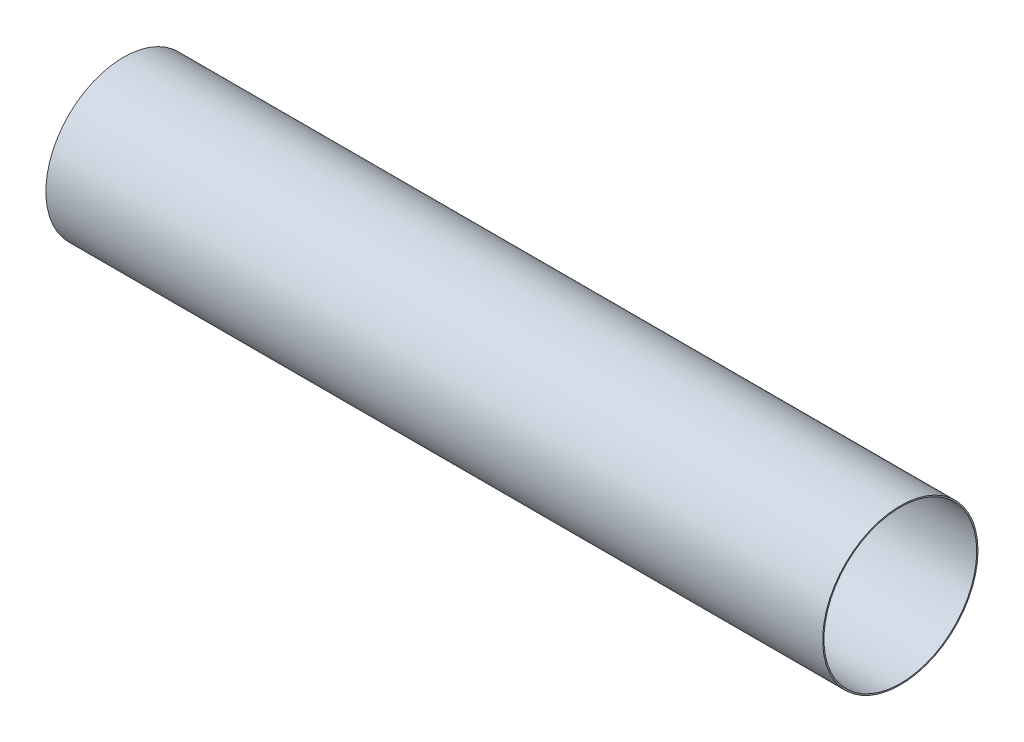
ISO-10303-21;
HEADER;
FILE_DESCRIPTION(('STEP AP214'),'2;1');
FILE_NAME('part.step','',(''),(''),'','','');
FILE_SCHEMA(('AUTOMOTIVE_DESIGN { 1 0 10303 214 1 1 1 1 }'));
ENDSEC;
DATA;
#1=APPLICATION_CONTEXT('core data for automotive mechanical design processes');
#2=APPLICATION_PROTOCOL_DEFINITION('international standard','automotive_design',2000,#1);
#3=PRODUCT_CONTEXT('',#1,'mechanical');
#4=PRODUCT('Part','Part','',(#3));
#5=PRODUCT_RELATED_PRODUCT_CATEGORY('part','',(#4));
#6=PRODUCT_DEFINITION_FORMATION('','',#4);
#7=PRODUCT_DEFINITION_CONTEXT('part definition',#1,'design');
#8=PRODUCT_DEFINITION('design','',#6,#7);
#9=PRODUCT_DEFINITION_SHAPE('','',#8);
#10=(LENGTH_UNIT() NAMED_UNIT(*) SI_UNIT(.MILLI.,.METRE.));
#11=(NAMED_UNIT(*) PLANE_ANGLE_UNIT() SI_UNIT($,.RADIAN.));
#12=(NAMED_UNIT(*) SI_UNIT($,.STERADIAN.) SOLID_ANGLE_UNIT());
#13=UNCERTAINTY_MEASURE_WITH_UNIT(LENGTH_MEASURE(1.E-05),#10,'distance_accuracy_value','');
#14=(GEOMETRIC_REPRESENTATION_CONTEXT(3) GLOBAL_UNCERTAINTY_ASSIGNED_CONTEXT((#13)) GLOBAL_UNIT_ASSIGNED_CONTEXT((#10,
#11,#12)) REPRESENTATION_CONTEXT('',''));
#15=CARTESIAN_POINT('',(0.,0.,0.));
#16=DIRECTION('',(0.,0.,1.));
#17=DIRECTION('',(1.,0.,0.));
#18=AXIS2_PLACEMENT_3D('',#15,#16,#17);
#19=CARTESIAN_POINT('',(-381.,0.,0.));
#20=DIRECTION('',(1.,0.,0.));
#21=DIRECTION('',(0.,0.,-1.));
#22=AXIS2_PLACEMENT_3D('',#19,#20,#21);
#23=CYLINDRICAL_SURFACE('',#22,76.2);
#24=CARTESIAN_POINT('',(-381.,0.,0.));
#25=DIRECTION('',(1.,0.,0.));
#26=DIRECTION('',(0.,0.,-1.));
#27=AXIS2_PLACEMENT_3D('',#24,#25,#26);
#28=CIRCLE('',#27,76.2);
#29=CARTESIAN_POINT('',(-381.,0.,-76.2));
#30=VERTEX_POINT('',#29);
#31=EDGE_CURVE('E10',#30,#30,#28,.T.);
#32=ORIENTED_EDGE('',*,*,#31,.T.);
#33=EDGE_LOOP('',(#32));
#34=FACE_BOUND('',#33,.T.);
#35=CARTESIAN_POINT('',(381.,0.,0.));
#36=DIRECTION('',(1.,0.,0.));
#37=DIRECTION('',(0.,0.,-1.));
#38=AXIS2_PLACEMENT_3D('',#35,#36,#37);
#39=CIRCLE('',#38,76.2);
#40=CARTESIAN_POINT('',(381.,0.,-76.2));
#41=VERTEX_POINT('',#40);
#42=EDGE_CURVE('E46',#41,#41,#39,.T.);
#43=ORIENTED_EDGE('',*,*,#42,.F.);
#44=EDGE_LOOP('',(#43));
#45=FACE_BOUND('',#44,.T.);
#46=ADVANCED_FACE('F43',(#34,#45),#23,.T.);
#47=CARTESIAN_POINT('',(-381.,0.,0.));
#48=DIRECTION('',(1.,0.,0.));
#49=DIRECTION('',(0.,0.,-1.));
#50=AXIS2_PLACEMENT_3D('',#47,#48,#49);
#51=PLANE('',#50);
#52=CARTESIAN_POINT('',(-381.,0.,0.));
#53=DIRECTION('',(1.,0.,0.));
#54=DIRECTION('',(0.,0.,-1.));
#55=AXIS2_PLACEMENT_3D('',#52,#53,#54);
#56=CIRCLE('',#55,74.93);
#57=CARTESIAN_POINT('',(-381.,0.,-74.93));
#58=VERTEX_POINT('',#57);
#59=EDGE_CURVE('E55',#58,#58,#56,.T.);
#60=ORIENTED_EDGE('',*,*,#59,.T.);
#61=EDGE_LOOP('',(#60));
#62=FACE_BOUND('',#61,.T.);
#63=ORIENTED_EDGE('',*,*,#31,.F.);
#64=EDGE_LOOP('',(#63));
#65=FACE_BOUND('',#64,.T.);
#66=ADVANCED_FACE('F65',(#62,#65),#51,.F.);
#67=CARTESIAN_POINT('',(381.,0.,0.));
#68=DIRECTION('',(1.,0.,0.));
#69=DIRECTION('',(0.,0.,-1.));
#70=AXIS2_PLACEMENT_3D('',#67,#68,#69);
#71=PLANE('',#70);
#72=CARTESIAN_POINT('',(381.,0.,0.));
#73=DIRECTION('',(1.,0.,0.));
#74=DIRECTION('',(0.,0.,-1.));
#75=AXIS2_PLACEMENT_3D('',#72,#73,#74);
#76=CIRCLE('',#75,74.93);
#77=CARTESIAN_POINT('',(381.,0.,-74.93));
#78=VERTEX_POINT('',#77);
#79=EDGE_CURVE('E57',#78,#78,#76,.T.);
#80=ORIENTED_EDGE('',*,*,#79,.F.);
#81=EDGE_LOOP('',(#80));
#82=FACE_BOUND('',#81,.T.);
#83=ORIENTED_EDGE('',*,*,#42,.T.);
#84=EDGE_LOOP('',(#83));
#85=FACE_BOUND('',#84,.T.);
#86=ADVANCED_FACE('F71',(#82,#85),#71,.T.);
#87=CARTESIAN_POINT('',(-381.,0.,0.));
#88=DIRECTION('',(1.,0.,0.));
#89=DIRECTION('',(0.,0.,-1.));
#90=AXIS2_PLACEMENT_3D('',#87,#88,#89);
#91=CYLINDRICAL_SURFACE('',#90,74.93);
#92=ORIENTED_EDGE('',*,*,#59,.F.);
#93=EDGE_LOOP('',(#92));
#94=FACE_BOUND('',#93,.T.);
#95=ORIENTED_EDGE('',*,*,#79,.T.);
#96=EDGE_LOOP('',(#95));
#97=FACE_BOUND('',#96,.T.);
#98=ADVANCED_FACE('F68',(#94,#97),#91,.F.);
#99=CLOSED_SHELL('',(#46,#66,#86,#98));
#100=MANIFOLD_SOLID_BREP('B2',#99);
#101=ADVANCED_BREP_SHAPE_REPRESENTATION('',(#18,#100),#14);
#102=SHAPE_DEFINITION_REPRESENTATION(#9,#101);
ENDSEC;
END-ISO-10303-21;
